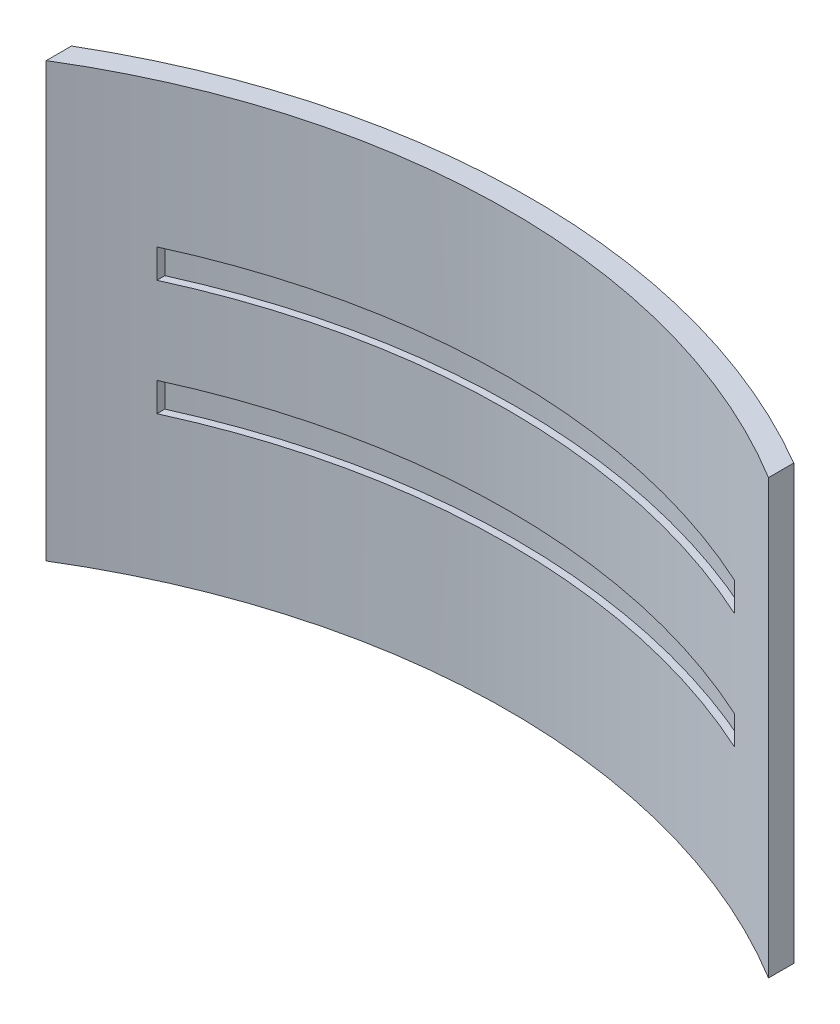
ISO-10303-21;
HEADER;
FILE_DESCRIPTION(('STEP AP214'),'2;1');
FILE_NAME('part.step','',(''),(''),'','','');
FILE_SCHEMA(('AUTOMOTIVE_DESIGN { 1 0 10303 214 1 1 1 1 }'));
ENDSEC;
DATA;
#1=APPLICATION_CONTEXT('core data for automotive mechanical design processes');
#2=APPLICATION_PROTOCOL_DEFINITION('international standard','automotive_design',2000,#1);
#3=PRODUCT_CONTEXT('',#1,'mechanical');
#4=PRODUCT('Part','Part','',(#3));
#5=PRODUCT_RELATED_PRODUCT_CATEGORY('part','',(#4));
#6=PRODUCT_DEFINITION_FORMATION('','',#4);
#7=PRODUCT_DEFINITION_CONTEXT('part definition',#1,'design');
#8=PRODUCT_DEFINITION('design','',#6,#7);
#9=PRODUCT_DEFINITION_SHAPE('','',#8);
#10=(LENGTH_UNIT() NAMED_UNIT(*) SI_UNIT(.MILLI.,.METRE.));
#11=(NAMED_UNIT(*) PLANE_ANGLE_UNIT() SI_UNIT($,.RADIAN.));
#12=(NAMED_UNIT(*) SI_UNIT($,.STERADIAN.) SOLID_ANGLE_UNIT());
#13=UNCERTAINTY_MEASURE_WITH_UNIT(LENGTH_MEASURE(1.E-05),#10,'distance_accuracy_value','');
#14=(GEOMETRIC_REPRESENTATION_CONTEXT(3) GLOBAL_UNCERTAINTY_ASSIGNED_CONTEXT((#13)) GLOBAL_UNIT_ASSIGNED_CONTEXT((#10,
#11,#12)) REPRESENTATION_CONTEXT('',''));
#15=CARTESIAN_POINT('',(0.,0.,0.));
#16=DIRECTION('',(0.,0.,1.));
#17=DIRECTION('',(1.,0.,0.));
#18=AXIS2_PLACEMENT_3D('',#15,#16,#17);
#19=CARTESIAN_POINT('',(0.,30.,0.));
#20=DIRECTION('',(0.,-1.,0.));
#21=DIRECTION('',(0.,0.,-1.));
#22=AXIS2_PLACEMENT_3D('',#19,#20,#21);
#23=CYLINDRICAL_SURFACE('',#22,49.5);
#24=CARTESIAN_POINT('',(0.,5.,0.));
#25=DIRECTION('',(0.,1.,0.));
#26=DIRECTION('',(0.,0.,1.));
#27=AXIS2_PLACEMENT_3D('',#24,#25,#26);
#28=CIRCLE('',#27,49.5);
#29=CARTESIAN_POINT('',(5.,5.,-49.2468273089749));
#30=VERTEX_POINT('',#29);
#31=CARTESIAN_POINT('',(3.,5.,-49.4090072760018));
#32=VERTEX_POINT('',#31);
#33=EDGE_CURVE('E321',#30,#32,#28,.T.);
#34=ORIENTED_EDGE('',*,*,#33,.F.);
#35=DIRECTION('',(0.,-1.,0.));
#36=VECTOR('',#35,1.);
#37=CARTESIAN_POINT('',(5.,30.,-49.2468273089749));
#38=LINE('',#37,#36);
#39=CARTESIAN_POINT('',(5.,25.,-49.2468273089749));
#40=VERTEX_POINT('',#39);
#41=EDGE_CURVE('E315',#40,#30,#38,.T.);
#42=ORIENTED_EDGE('',*,*,#41,.F.);
#43=CARTESIAN_POINT('',(0.,25.,0.));
#44=DIRECTION('',(0.,-1.,0.));
#45=DIRECTION('',(0.,0.,-1.));
#46=AXIS2_PLACEMENT_3D('',#43,#44,#45);
#47=CIRCLE('',#46,49.5);
#48=CARTESIAN_POINT('',(3.,25.,-49.4090072760018));
#49=VERTEX_POINT('',#48);
#50=EDGE_CURVE('E317',#49,#40,#47,.T.);
#51=ORIENTED_EDGE('',*,*,#50,.F.);
#52=DIRECTION('',(0.,-1.,0.));
#53=VECTOR('',#52,1.);
#54=CARTESIAN_POINT('',(3.,30.,-49.4090072760018));
#55=LINE('',#54,#53);
#56=EDGE_CURVE('E319',#32,#49,#55,.F.);
#57=ORIENTED_EDGE('',*,*,#56,.F.);
#58=EDGE_LOOP('',(#34,#42,#51,#57));
#59=FACE_BOUND('',#58,.T.);
#60=CARTESIAN_POINT('',(0.,0.,0.));
#61=DIRECTION('',(0.,1.,0.));
#62=DIRECTION('',(0.,0.,1.));
#63=AXIS2_PLACEMENT_3D('',#60,#61,#62);
#64=CIRCLE('',#63,49.5);
#65=CARTESIAN_POINT('',(25.,0.,-42.722944655068));
#66=VERTEX_POINT('',#65);
#67=CARTESIAN_POINT('',(-25.,0.,-42.722944655068));
#68=VERTEX_POINT('',#67);
#69=EDGE_CURVE('E283',#66,#68,#64,.T.);
#70=ORIENTED_EDGE('',*,*,#69,.T.);
#71=DIRECTION('',(0.,-1.,0.));
#72=VECTOR('',#71,1.);
#73=CARTESIAN_POINT('',(-25.,30.,-42.722944655068));
#74=LINE('',#73,#72);
#75=CARTESIAN_POINT('',(-25.,30.,-42.722944655068));
#76=VERTEX_POINT('',#75);
#77=EDGE_CURVE('E288',#76,#68,#74,.T.);
#78=ORIENTED_EDGE('',*,*,#77,.F.);
#79=CARTESIAN_POINT('',(0.,30.,0.));
#80=DIRECTION('',(0.,1.,0.));
#81=DIRECTION('',(0.,0.,1.));
#82=AXIS2_PLACEMENT_3D('',#79,#80,#81);
#83=CIRCLE('',#82,49.5);
#84=CARTESIAN_POINT('',(25.,30.,-42.722944655068));
#85=VERTEX_POINT('',#84);
#86=EDGE_CURVE('E274',#85,#76,#83,.T.);
#87=ORIENTED_EDGE('',*,*,#86,.F.);
#88=DIRECTION('',(0.,-1.,0.));
#89=VECTOR('',#88,1.);
#90=CARTESIAN_POINT('',(25.,30.,-42.722944655068));
#91=LINE('',#90,#89);
#92=EDGE_CURVE('E291',#85,#66,#91,.T.);
#93=ORIENTED_EDGE('',*,*,#92,.T.);
#94=EDGE_LOOP('',(#70,#78,#87,#93));
#95=FACE_BOUND('',#94,.T.);
#96=CARTESIAN_POINT('',(0.,25.,0.));
#97=DIRECTION('',(0.,-1.,0.));
#98=DIRECTION('',(0.,0.,-1.));
#99=AXIS2_PLACEMENT_3D('',#96,#97,#98);
#100=CIRCLE('',#99,49.5);
#101=CARTESIAN_POINT('',(-5.,25.,-49.2468273089749));
#102=VERTEX_POINT('',#101);
#103=CARTESIAN_POINT('',(-3.,25.,-49.4090072760018));
#104=VERTEX_POINT('',#103);
#105=EDGE_CURVE('E12',#102,#104,#100,.T.);
#106=ORIENTED_EDGE('',*,*,#105,.F.);
#107=DIRECTION('',(0.,-1.,0.));
#108=VECTOR('',#107,1.);
#109=CARTESIAN_POINT('',(-5.,30.,-49.2468273089749));
#110=LINE('',#109,#108);
#111=CARTESIAN_POINT('',(-5.,5.,-49.2468273089749));
#112=VERTEX_POINT('',#111);
#113=EDGE_CURVE('E323',#112,#102,#110,.F.);
#114=ORIENTED_EDGE('',*,*,#113,.F.);
#115=CARTESIAN_POINT('',(0.,5.,0.));
#116=DIRECTION('',(0.,1.,0.));
#117=DIRECTION('',(0.,0.,1.));
#118=AXIS2_PLACEMENT_3D('',#115,#116,#117);
#119=CIRCLE('',#118,49.5);
#120=CARTESIAN_POINT('',(-3.,5.,-49.4090072760018));
#121=VERTEX_POINT('',#120);
#122=EDGE_CURVE('E325',#121,#112,#119,.T.);
#123=ORIENTED_EDGE('',*,*,#122,.F.);
#124=DIRECTION('',(0.,-1.,0.));
#125=VECTOR('',#124,1.);
#126=CARTESIAN_POINT('',(-3.,30.,-49.4090072760018));
#127=LINE('',#126,#125);
#128=EDGE_CURVE('E43',#104,#121,#127,.T.);
#129=ORIENTED_EDGE('',*,*,#128,.F.);
#130=EDGE_LOOP('',(#106,#114,#123,#129));
#131=FACE_BOUND('',#130,.T.);
#132=ADVANCED_FACE('F35',(#59,#95,#131),#23,.T.);
#133=CARTESIAN_POINT('',(0.,30.,0.));
#134=DIRECTION('',(0.,-1.,0.));
#135=DIRECTION('',(0.,0.,-1.));
#136=AXIS2_PLACEMENT_3D('',#133,#134,#135);
#137=CYLINDRICAL_SURFACE('',#136,48.);
#138=DIRECTION('',(0.,-1.,0.));
#139=VECTOR('',#138,1.);
#140=CARTESIAN_POINT('',(-20.0000000000003,30.,-43.6348484585427));
#141=LINE('',#140,#139);
#142=CARTESIAN_POINT('',(-20.0000000000003,12.,-43.6348484585427));
#143=VERTEX_POINT('',#142);
#144=CARTESIAN_POINT('',(-20.0000000000003,10.,-43.6348484585427));
#145=VERTEX_POINT('',#144);
#146=EDGE_CURVE('E304',#143,#145,#141,.T.);
#147=ORIENTED_EDGE('',*,*,#146,.F.);
#148=CARTESIAN_POINT('',(0.,12.,0.));
#149=DIRECTION('',(0.,-1.,0.));
#150=DIRECTION('',(0.,0.,-1.));
#151=AXIS2_PLACEMENT_3D('',#148,#149,#150);
#152=CIRCLE('',#151,48.);
#153=CARTESIAN_POINT('',(19.9999999999997,12.,-43.634848458543));
#154=VERTEX_POINT('',#153);
#155=EDGE_CURVE('E297',#154,#143,#152,.F.);
#156=ORIENTED_EDGE('',*,*,#155,.F.);
#157=DIRECTION('',(0.,-1.,0.));
#158=VECTOR('',#157,1.);
#159=CARTESIAN_POINT('',(19.9999999999997,30.,-43.634848458543));
#160=LINE('',#159,#158);
#161=CARTESIAN_POINT('',(19.9999999999997,10.,-43.634848458543));
#162=VERTEX_POINT('',#161);
#163=EDGE_CURVE('E299',#162,#154,#160,.F.);
#164=ORIENTED_EDGE('',*,*,#163,.F.);
#165=CARTESIAN_POINT('',(0.,10.,0.));
#166=DIRECTION('',(0.,1.,0.));
#167=DIRECTION('',(0.,0.,1.));
#168=AXIS2_PLACEMENT_3D('',#165,#166,#167);
#169=CIRCLE('',#168,48.);
#170=EDGE_CURVE('E302',#145,#162,#169,.F.);
#171=ORIENTED_EDGE('',*,*,#170,.F.);
#172=EDGE_LOOP('',(#147,#156,#164,#171));
#173=FACE_BOUND('',#172,.T.);
#174=CARTESIAN_POINT('',(0.,0.,0.));
#175=DIRECTION('',(0.,-1.,0.));
#176=DIRECTION('',(0.,0.,1.));
#177=AXIS2_PLACEMENT_3D('',#174,#175,#176);
#178=CIRCLE('',#177,48.);
#179=CARTESIAN_POINT('',(-25.,0.,-40.9756024970958));
#180=VERTEX_POINT('',#179);
#181=CARTESIAN_POINT('',(25.,0.,-40.9756024970958));
#182=VERTEX_POINT('',#181);
#183=EDGE_CURVE('E231',#180,#182,#178,.T.);
#184=ORIENTED_EDGE('',*,*,#183,.T.);
#185=DIRECTION('',(0.,-1.,0.));
#186=VECTOR('',#185,1.);
#187=CARTESIAN_POINT('',(25.,30.,-40.9756024970958));
#188=LINE('',#187,#186);
#189=CARTESIAN_POINT('',(25.,30.,-40.9756024970958));
#190=VERTEX_POINT('',#189);
#191=EDGE_CURVE('E294',#190,#182,#188,.T.);
#192=ORIENTED_EDGE('',*,*,#191,.F.);
#193=CARTESIAN_POINT('',(0.,30.,0.));
#194=DIRECTION('',(0.,-1.,0.));
#195=DIRECTION('',(0.,0.,1.));
#196=AXIS2_PLACEMENT_3D('',#193,#194,#195);
#197=CIRCLE('',#196,48.);
#198=CARTESIAN_POINT('',(-25.,30.,-40.9756024970958));
#199=VERTEX_POINT('',#198);
#200=EDGE_CURVE('E268',#199,#190,#197,.T.);
#201=ORIENTED_EDGE('',*,*,#200,.F.);
#202=DIRECTION('',(0.,-1.,0.));
#203=VECTOR('',#202,1.);
#204=CARTESIAN_POINT('',(-25.,30.,-40.9756024970958));
#205=LINE('',#204,#203);
#206=EDGE_CURVE('E278',#199,#180,#205,.T.);
#207=ORIENTED_EDGE('',*,*,#206,.T.);
#208=EDGE_LOOP('',(#184,#192,#201,#207));
#209=FACE_BOUND('',#208,.T.);
#210=CARTESIAN_POINT('',(0.,20.,0.));
#211=DIRECTION('',(0.,-1.,0.));
#212=DIRECTION('',(0.,0.,-1.));
#213=AXIS2_PLACEMENT_3D('',#210,#211,#212);
#214=CIRCLE('',#213,48.);
#215=CARTESIAN_POINT('',(19.9999999999997,20.,-43.634848458543));
#216=VERTEX_POINT('',#215);
#217=CARTESIAN_POINT('',(-20.0000000000003,20.,-43.6348484585427));
#218=VERTEX_POINT('',#217);
#219=EDGE_CURVE('E313',#216,#218,#214,.F.);
#220=ORIENTED_EDGE('',*,*,#219,.F.);
#221=DIRECTION('',(0.,-1.,0.));
#222=VECTOR('',#221,1.);
#223=CARTESIAN_POINT('',(19.9999999999997,30.,-43.634848458543));
#224=LINE('',#223,#222);
#225=CARTESIAN_POINT('',(19.9999999999997,18.,-43.634848458543));
#226=VERTEX_POINT('',#225);
#227=EDGE_CURVE('E306',#226,#216,#224,.F.);
#228=ORIENTED_EDGE('',*,*,#227,.F.);
#229=CARTESIAN_POINT('',(0.,18.,0.));
#230=DIRECTION('',(0.,1.,0.));
#231=DIRECTION('',(0.,0.,1.));
#232=AXIS2_PLACEMENT_3D('',#229,#230,#231);
#233=CIRCLE('',#232,48.);
#234=CARTESIAN_POINT('',(-20.0000000000003,18.,-43.6348484585427));
#235=VERTEX_POINT('',#234);
#236=EDGE_CURVE('E308',#235,#226,#233,.F.);
#237=ORIENTED_EDGE('',*,*,#236,.F.);
#238=DIRECTION('',(0.,-1.,0.));
#239=VECTOR('',#238,1.);
#240=CARTESIAN_POINT('',(-20.0000000000003,30.,-43.6348484585427));
#241=LINE('',#240,#239);
#242=EDGE_CURVE('E311',#218,#235,#241,.T.);
#243=ORIENTED_EDGE('',*,*,#242,.F.);
#244=EDGE_LOOP('',(#220,#228,#237,#243));
#245=FACE_BOUND('',#244,.T.);
#246=ADVANCED_FACE('F37',(#173,#209,#245),#137,.F.);
#247=CARTESIAN_POINT('',(25.,30.,-42.722944655068));
#248=DIRECTION('',(-1.,0.,0.));
#249=DIRECTION('',(0.,0.,1.));
#250=AXIS2_PLACEMENT_3D('',#247,#248,#249);
#251=PLANE('',#250);
#252=DIRECTION('',(0.,0.,-1.));
#253=VECTOR('',#252,1.);
#254=CARTESIAN_POINT('',(25.,0.,-42.722944655068));
#255=LINE('',#254,#253);
#256=EDGE_CURVE('E281',#182,#66,#255,.T.);
#257=ORIENTED_EDGE('',*,*,#256,.T.);
#258=ORIENTED_EDGE('',*,*,#92,.F.);
#259=DIRECTION('',(0.,0.,-1.));
#260=VECTOR('',#259,1.);
#261=CARTESIAN_POINT('',(25.,30.,-42.722944655068));
#262=LINE('',#261,#260);
#263=EDGE_CURVE('E271',#190,#85,#262,.T.);
#264=ORIENTED_EDGE('',*,*,#263,.F.);
#265=ORIENTED_EDGE('',*,*,#191,.T.);
#266=EDGE_LOOP('',(#257,#258,#264,#265));
#267=FACE_BOUND('',#266,.T.);
#268=ADVANCED_FACE('F352',(#267),#251,.F.);
#269=CARTESIAN_POINT('',(-25.,30.,-42.722944655068));
#270=DIRECTION('',(1.,0.,0.));
#271=DIRECTION('',(0.,0.,-1.));
#272=AXIS2_PLACEMENT_3D('',#269,#270,#271);
#273=PLANE('',#272);
#274=DIRECTION('',(0.,0.,1.));
#275=VECTOR('',#274,1.);
#276=CARTESIAN_POINT('',(-25.,0.,-42.722944655068));
#277=LINE('',#276,#275);
#278=EDGE_CURVE('E272',#68,#180,#277,.T.);
#279=ORIENTED_EDGE('',*,*,#278,.T.);
#280=ORIENTED_EDGE('',*,*,#206,.F.);
#281=DIRECTION('',(0.,0.,1.));
#282=VECTOR('',#281,1.);
#283=CARTESIAN_POINT('',(-25.,30.,-42.722944655068));
#284=LINE('',#283,#282);
#285=EDGE_CURVE('E276',#76,#199,#284,.T.);
#286=ORIENTED_EDGE('',*,*,#285,.F.);
#287=ORIENTED_EDGE('',*,*,#77,.T.);
#288=EDGE_LOOP('',(#279,#280,#286,#287));
#289=FACE_BOUND('',#288,.T.);
#290=ADVANCED_FACE('F357',(#289),#273,.F.);
#291=CARTESIAN_POINT('',(0.,30.,0.));
#292=DIRECTION('',(0.,1.,0.));
#293=DIRECTION('',(0.,0.,1.));
#294=AXIS2_PLACEMENT_3D('',#291,#292,#293);
#295=PLANE('',#294);
#296=ORIENTED_EDGE('',*,*,#200,.T.);
#297=ORIENTED_EDGE('',*,*,#263,.T.);
#298=ORIENTED_EDGE('',*,*,#86,.T.);
#299=ORIENTED_EDGE('',*,*,#285,.T.);
#300=EDGE_LOOP('',(#296,#297,#298,#299));
#301=FACE_BOUND('',#300,.T.);
#302=ADVANCED_FACE('F364',(#301),#295,.T.);
#303=CARTESIAN_POINT('',(0.,0.,0.));
#304=DIRECTION('',(0.,1.,0.));
#305=DIRECTION('',(0.,0.,1.));
#306=AXIS2_PLACEMENT_3D('',#303,#304,#305);
#307=PLANE('',#306);
#308=ORIENTED_EDGE('',*,*,#183,.F.);
#309=ORIENTED_EDGE('',*,*,#278,.F.);
#310=ORIENTED_EDGE('',*,*,#69,.F.);
#311=ORIENTED_EDGE('',*,*,#256,.F.);
#312=EDGE_LOOP('',(#308,#309,#310,#311));
#313=FACE_BOUND('',#312,.T.);
#314=ADVANCED_FACE('F374',(#313),#307,.F.);
#315=CARTESIAN_POINT('',(-20.0000000000004,12.,-51.501));
#316=DIRECTION('',(1.,0.,0.));
#317=DIRECTION('',(0.,0.,-1.));
#318=AXIS2_PLACEMENT_3D('',#315,#316,#317);
#319=PLANE('',#318);
#320=ORIENTED_EDGE('',*,*,#146,.T.);
#321=DIRECTION('',(0.,0.,1.));
#322=VECTOR('',#321,1.);
#323=CARTESIAN_POINT('',(-20.0000000000004,10.,-51.501));
#324=LINE('',#323,#322);
#325=CARTESIAN_POINT('',(-20.0000000000003,10.,-44.1842732202306));
#326=VERTEX_POINT('',#325);
#327=EDGE_CURVE('E258',#326,#145,#324,.T.);
#328=ORIENTED_EDGE('',*,*,#327,.F.);
#329=DIRECTION('',(0.,-1.,0.));
#330=VECTOR('',#329,1.);
#331=CARTESIAN_POINT('',(-20.0000000000003,30.,-44.1842732202306));
#332=LINE('',#331,#330);
#333=CARTESIAN_POINT('',(-20.0000000000003,12.,-44.1842732202306));
#334=VERTEX_POINT('',#333);
#335=EDGE_CURVE('E250',#334,#326,#332,.T.);
#336=ORIENTED_EDGE('',*,*,#335,.F.);
#337=DIRECTION('',(0.,0.,1.));
#338=VECTOR('',#337,1.);
#339=CARTESIAN_POINT('',(-20.0000000000004,12.,-51.501));
#340=LINE('',#339,#338);
#341=EDGE_CURVE('E255',#334,#143,#340,.T.);
#342=ORIENTED_EDGE('',*,*,#341,.T.);
#343=EDGE_LOOP('',(#320,#328,#336,#342));
#344=FACE_BOUND('',#343,.T.);
#345=ADVANCED_FACE('F386',(#344),#319,.T.);
#346=CARTESIAN_POINT('',(19.9999999999996,10.,-51.5010000000003));
#347=DIRECTION('',(0.,1.,0.));
#348=DIRECTION('',(0.,0.,1.));
#349=AXIS2_PLACEMENT_3D('',#346,#347,#348);
#350=PLANE('',#349);
#351=ORIENTED_EDGE('',*,*,#170,.T.);
#352=DIRECTION('',(0.,0.,1.));
#353=VECTOR('',#352,1.);
#354=CARTESIAN_POINT('',(19.9999999999996,10.,-51.5010000000003));
#355=LINE('',#354,#353);
#356=CARTESIAN_POINT('',(19.9999999999997,10.,-44.1842732202309));
#357=VERTEX_POINT('',#356);
#358=EDGE_CURVE('E261',#357,#162,#355,.T.);
#359=ORIENTED_EDGE('',*,*,#358,.F.);
#360=CARTESIAN_POINT('',(0.,10.,0.));
#361=DIRECTION('',(0.,1.,0.));
#362=DIRECTION('',(0.,0.,1.));
#363=AXIS2_PLACEMENT_3D('',#360,#361,#362);
#364=CIRCLE('',#363,48.5);
#365=EDGE_CURVE('E246',#326,#357,#364,.F.);
#366=ORIENTED_EDGE('',*,*,#365,.F.);
#367=ORIENTED_EDGE('',*,*,#327,.T.);
#368=EDGE_LOOP('',(#351,#359,#366,#367));
#369=FACE_BOUND('',#368,.T.);
#370=ADVANCED_FACE('F396',(#369),#350,.T.);
#371=CARTESIAN_POINT('',(19.9999999999996,12.,-51.5010000000003));
#372=DIRECTION('',(-1.,0.,0.));
#373=DIRECTION('',(0.,0.,1.));
#374=AXIS2_PLACEMENT_3D('',#371,#372,#373);
#375=PLANE('',#374);
#376=ORIENTED_EDGE('',*,*,#163,.T.);
#377=DIRECTION('',(0.,0.,1.));
#378=VECTOR('',#377,1.);
#379=CARTESIAN_POINT('',(19.9999999999996,12.,-51.5010000000003));
#380=LINE('',#379,#378);
#381=CARTESIAN_POINT('',(19.9999999999997,12.,-44.1842732202309));
#382=VERTEX_POINT('',#381);
#383=EDGE_CURVE('E264',#382,#154,#380,.T.);
#384=ORIENTED_EDGE('',*,*,#383,.F.);
#385=DIRECTION('',(0.,-1.,0.));
#386=VECTOR('',#385,1.);
#387=CARTESIAN_POINT('',(19.9999999999997,30.,-44.1842732202309));
#388=LINE('',#387,#386);
#389=EDGE_CURVE('E249',#357,#382,#388,.F.);
#390=ORIENTED_EDGE('',*,*,#389,.F.);
#391=ORIENTED_EDGE('',*,*,#358,.T.);
#392=EDGE_LOOP('',(#376,#384,#390,#391));
#393=FACE_BOUND('',#392,.T.);
#394=ADVANCED_FACE('F392',(#393),#375,.T.);
#395=CARTESIAN_POINT('',(19.9999999999996,12.,-51.5010000000003));
#396=DIRECTION('',(0.,-1.,0.));
#397=DIRECTION('',(0.,0.,-1.));
#398=AXIS2_PLACEMENT_3D('',#395,#396,#397);
#399=PLANE('',#398);
#400=ORIENTED_EDGE('',*,*,#155,.T.);
#401=ORIENTED_EDGE('',*,*,#341,.F.);
#402=CARTESIAN_POINT('',(0.,12.,0.));
#403=DIRECTION('',(0.,-1.,0.));
#404=DIRECTION('',(0.,0.,-1.));
#405=AXIS2_PLACEMENT_3D('',#402,#403,#404);
#406=CIRCLE('',#405,48.5);
#407=EDGE_CURVE('E236',#382,#334,#406,.F.);
#408=ORIENTED_EDGE('',*,*,#407,.F.);
#409=ORIENTED_EDGE('',*,*,#383,.T.);
#410=EDGE_LOOP('',(#400,#401,#408,#409));
#411=FACE_BOUND('',#410,.T.);
#412=ADVANCED_FACE('F388',(#411),#399,.T.);
#413=CARTESIAN_POINT('',(0.,30.,0.));
#414=DIRECTION('',(0.,-1.,0.));
#415=DIRECTION('',(0.,0.,-1.));
#416=AXIS2_PLACEMENT_3D('',#413,#414,#415);
#417=CYLINDRICAL_SURFACE('',#416,48.5);
#418=ORIENTED_EDGE('',*,*,#389,.T.);
#419=ORIENTED_EDGE('',*,*,#407,.T.);
#420=ORIENTED_EDGE('',*,*,#335,.T.);
#421=ORIENTED_EDGE('',*,*,#365,.T.);
#422=EDGE_LOOP('',(#418,#419,#420,#421));
#423=FACE_BOUND('',#422,.T.);
#424=ADVANCED_FACE('F391',(#423),#417,.F.);
#425=CARTESIAN_POINT('',(19.9999999999996,20.,-51.5010000000003));
#426=DIRECTION('',(0.,-1.,0.));
#427=DIRECTION('',(0.,0.,-1.));
#428=AXIS2_PLACEMENT_3D('',#425,#426,#427);
#429=PLANE('',#428);
#430=ORIENTED_EDGE('',*,*,#219,.T.);
#431=DIRECTION('',(0.,0.,1.));
#432=VECTOR('',#431,1.);
#433=CARTESIAN_POINT('',(-20.0000000000004,20.,-51.501));
#434=LINE('',#433,#432);
#435=CARTESIAN_POINT('',(-20.0000000000003,20.,-44.1842732202306));
#436=VERTEX_POINT('',#435);
#437=EDGE_CURVE('E235',#436,#218,#434,.T.);
#438=ORIENTED_EDGE('',*,*,#437,.F.);
#439=CARTESIAN_POINT('',(0.,20.,0.));
#440=DIRECTION('',(0.,-1.,0.));
#441=DIRECTION('',(0.,0.,-1.));
#442=AXIS2_PLACEMENT_3D('',#439,#440,#441);
#443=CIRCLE('',#442,48.5);
#444=CARTESIAN_POINT('',(19.9999999999997,20.,-44.1842732202309));
#445=VERTEX_POINT('',#444);
#446=EDGE_CURVE('E225',#445,#436,#443,.F.);
#447=ORIENTED_EDGE('',*,*,#446,.F.);
#448=DIRECTION('',(0.,0.,1.));
#449=VECTOR('',#448,1.);
#450=CARTESIAN_POINT('',(19.9999999999996,20.,-51.5010000000003));
#451=LINE('',#450,#449);
#452=EDGE_CURVE('E232',#445,#216,#451,.T.);
#453=ORIENTED_EDGE('',*,*,#452,.T.);
#454=EDGE_LOOP('',(#430,#438,#447,#453));
#455=FACE_BOUND('',#454,.T.);
#456=ADVANCED_FACE('F406',(#455),#429,.T.);
#457=CARTESIAN_POINT('',(-20.0000000000004,18.,-51.501));
#458=DIRECTION('',(1.,0.,0.));
#459=DIRECTION('',(0.,0.,-1.));
#460=AXIS2_PLACEMENT_3D('',#457,#458,#459);
#461=PLANE('',#460);
#462=ORIENTED_EDGE('',*,*,#242,.T.);
#463=DIRECTION('',(0.,0.,1.));
#464=VECTOR('',#463,1.);
#465=CARTESIAN_POINT('',(-20.0000000000004,18.,-51.501));
#466=LINE('',#465,#464);
#467=CARTESIAN_POINT('',(-20.0000000000003,18.,-44.1842732202306));
#468=VERTEX_POINT('',#467);
#469=EDGE_CURVE('E239',#468,#235,#466,.T.);
#470=ORIENTED_EDGE('',*,*,#469,.F.);
#471=DIRECTION('',(0.,-1.,0.));
#472=VECTOR('',#471,1.);
#473=CARTESIAN_POINT('',(-20.0000000000003,30.,-44.1842732202306));
#474=LINE('',#473,#472);
#475=EDGE_CURVE('E221',#436,#468,#474,.T.);
#476=ORIENTED_EDGE('',*,*,#475,.F.);
#477=ORIENTED_EDGE('',*,*,#437,.T.);
#478=EDGE_LOOP('',(#462,#470,#476,#477));
#479=FACE_BOUND('',#478,.T.);
#480=ADVANCED_FACE('F416',(#479),#461,.T.);
#481=CARTESIAN_POINT('',(19.9999999999996,18.,-51.5010000000003));
#482=DIRECTION('',(0.,1.,0.));
#483=DIRECTION('',(0.,0.,1.));
#484=AXIS2_PLACEMENT_3D('',#481,#482,#483);
#485=PLANE('',#484);
#486=ORIENTED_EDGE('',*,*,#236,.T.);
#487=DIRECTION('',(0.,0.,1.));
#488=VECTOR('',#487,1.);
#489=CARTESIAN_POINT('',(19.9999999999996,18.,-51.5010000000003));
#490=LINE('',#489,#488);
#491=CARTESIAN_POINT('',(19.9999999999997,18.,-44.1842732202309));
#492=VERTEX_POINT('',#491);
#493=EDGE_CURVE('E242',#492,#226,#490,.T.);
#494=ORIENTED_EDGE('',*,*,#493,.F.);
#495=CARTESIAN_POINT('',(0.,18.,0.));
#496=DIRECTION('',(0.,1.,0.));
#497=DIRECTION('',(0.,0.,1.));
#498=AXIS2_PLACEMENT_3D('',#495,#496,#497);
#499=CIRCLE('',#498,48.5);
#500=EDGE_CURVE('E224',#468,#492,#499,.F.);
#501=ORIENTED_EDGE('',*,*,#500,.F.);
#502=ORIENTED_EDGE('',*,*,#469,.T.);
#503=EDGE_LOOP('',(#486,#494,#501,#502));
#504=FACE_BOUND('',#503,.T.);
#505=ADVANCED_FACE('F412',(#504),#485,.T.);
#506=CARTESIAN_POINT('',(19.9999999999996,18.,-51.5010000000003));
#507=DIRECTION('',(-1.,0.,0.));
#508=DIRECTION('',(0.,0.,1.));
#509=AXIS2_PLACEMENT_3D('',#506,#507,#508);
#510=PLANE('',#509);
#511=ORIENTED_EDGE('',*,*,#227,.T.);
#512=ORIENTED_EDGE('',*,*,#452,.F.);
#513=DIRECTION('',(0.,-1.,0.));
#514=VECTOR('',#513,1.);
#515=CARTESIAN_POINT('',(19.9999999999997,30.,-44.1842732202309));
#516=LINE('',#515,#514);
#517=EDGE_CURVE('E228',#492,#445,#516,.F.);
#518=ORIENTED_EDGE('',*,*,#517,.F.);
#519=ORIENTED_EDGE('',*,*,#493,.T.);
#520=EDGE_LOOP('',(#511,#512,#518,#519));
#521=FACE_BOUND('',#520,.T.);
#522=ADVANCED_FACE('F408',(#521),#510,.T.);
#523=CARTESIAN_POINT('',(0.,30.,0.));
#524=DIRECTION('',(0.,-1.,0.));
#525=DIRECTION('',(0.,0.,-1.));
#526=AXIS2_PLACEMENT_3D('',#523,#524,#525);
#527=CYLINDRICAL_SURFACE('',#526,48.5);
#528=ORIENTED_EDGE('',*,*,#500,.T.);
#529=ORIENTED_EDGE('',*,*,#517,.T.);
#530=ORIENTED_EDGE('',*,*,#446,.T.);
#531=ORIENTED_EDGE('',*,*,#475,.T.);
#532=EDGE_LOOP('',(#528,#529,#530,#531));
#533=FACE_BOUND('',#532,.T.);
#534=ADVANCED_FACE('F411',(#533),#527,.F.);
#535=CARTESIAN_POINT('',(5.,5.,-38.9746024970958));
#536=DIRECTION('',(0.,1.,0.));
#537=DIRECTION('',(0.,0.,1.));
#538=AXIS2_PLACEMENT_3D('',#535,#536,#537);
#539=PLANE('',#538);
#540=ORIENTED_EDGE('',*,*,#33,.T.);
#541=DIRECTION('',(0.,0.,-1.));
#542=VECTOR('',#541,1.);
#543=CARTESIAN_POINT('',(3.,5.,-38.9746024970958));
#544=LINE('',#543,#542);
#545=CARTESIAN_POINT('',(3.,5.,-48.9080770425499));
#546=VERTEX_POINT('',#545);
#547=EDGE_CURVE('E212',#546,#32,#544,.T.);
#548=ORIENTED_EDGE('',*,*,#547,.F.);
#549=CARTESIAN_POINT('',(0.,5.,0.));
#550=DIRECTION('',(0.,1.,0.));
#551=DIRECTION('',(0.,0.,1.));
#552=AXIS2_PLACEMENT_3D('',#549,#550,#551);
#553=CIRCLE('',#552,49.);
#554=CARTESIAN_POINT('',(5.,5.,-48.7442304278158));
#555=VERTEX_POINT('',#554);
#556=EDGE_CURVE('E203',#555,#546,#553,.T.);
#557=ORIENTED_EDGE('',*,*,#556,.F.);
#558=DIRECTION('',(0.,0.,-1.));
#559=VECTOR('',#558,1.);
#560=CARTESIAN_POINT('',(5.,5.,-38.9746024970958));
#561=LINE('',#560,#559);
#562=EDGE_CURVE('E209',#555,#30,#561,.T.);
#563=ORIENTED_EDGE('',*,*,#562,.T.);
#564=EDGE_LOOP('',(#540,#548,#557,#563));
#565=FACE_BOUND('',#564,.T.);
#566=ADVANCED_FACE('F426',(#565),#539,.T.);
#567=CARTESIAN_POINT('',(3.,5.,-38.9746024970958));
#568=DIRECTION('',(1.,0.,0.));
#569=DIRECTION('',(0.,0.,-1.));
#570=AXIS2_PLACEMENT_3D('',#567,#568,#569);
#571=PLANE('',#570);
#572=ORIENTED_EDGE('',*,*,#56,.T.);
#573=DIRECTION('',(0.,0.,-1.));
#574=VECTOR('',#573,1.);
#575=CARTESIAN_POINT('',(3.,25.,-38.9746024970958));
#576=LINE('',#575,#574);
#577=CARTESIAN_POINT('',(3.,25.,-48.9080770425499));
#578=VERTEX_POINT('',#577);
#579=EDGE_CURVE('E215',#578,#49,#576,.T.);
#580=ORIENTED_EDGE('',*,*,#579,.F.);
#581=DIRECTION('',(0.,-1.,0.));
#582=VECTOR('',#581,1.);
#583=CARTESIAN_POINT('',(3.,30.,-48.9080770425499));
#584=LINE('',#583,#582);
#585=EDGE_CURVE('E199',#546,#578,#584,.F.);
#586=ORIENTED_EDGE('',*,*,#585,.F.);
#587=ORIENTED_EDGE('',*,*,#547,.T.);
#588=EDGE_LOOP('',(#572,#580,#586,#587));
#589=FACE_BOUND('',#588,.T.);
#590=ADVANCED_FACE('F435',(#589),#571,.T.);
#591=CARTESIAN_POINT('',(5.,25.,-38.9746024970958));
#592=DIRECTION('',(0.,-1.,0.));
#593=DIRECTION('',(0.,0.,-1.));
#594=AXIS2_PLACEMENT_3D('',#591,#592,#593);
#595=PLANE('',#594);
#596=ORIENTED_EDGE('',*,*,#50,.T.);
#597=DIRECTION('',(0.,0.,-1.));
#598=VECTOR('',#597,1.);
#599=CARTESIAN_POINT('',(5.,25.,-38.9746024970958));
#600=LINE('',#599,#598);
#601=CARTESIAN_POINT('',(5.,25.,-48.7442304278158));
#602=VERTEX_POINT('',#601);
#603=EDGE_CURVE('E58',#602,#40,#600,.T.);
#604=ORIENTED_EDGE('',*,*,#603,.F.);
#605=CARTESIAN_POINT('',(0.,25.,0.));
#606=DIRECTION('',(0.,-1.,0.));
#607=DIRECTION('',(0.,0.,-1.));
#608=AXIS2_PLACEMENT_3D('',#605,#606,#607);
#609=CIRCLE('',#608,49.);
#610=EDGE_CURVE('E202',#578,#602,#609,.T.);
#611=ORIENTED_EDGE('',*,*,#610,.F.);
#612=ORIENTED_EDGE('',*,*,#579,.T.);
#613=EDGE_LOOP('',(#596,#604,#611,#612));
#614=FACE_BOUND('',#613,.T.);
#615=ADVANCED_FACE('F432',(#614),#595,.T.);
#616=CARTESIAN_POINT('',(5.,5.,-38.9746024970958));
#617=DIRECTION('',(-1.,0.,0.));
#618=DIRECTION('',(0.,-1.,0.));
#619=AXIS2_PLACEMENT_3D('',#616,#617,#618);
#620=PLANE('',#619);
#621=ORIENTED_EDGE('',*,*,#41,.T.);
#622=ORIENTED_EDGE('',*,*,#562,.F.);
#623=DIRECTION('',(0.,-1.,0.));
#624=VECTOR('',#623,1.);
#625=CARTESIAN_POINT('',(5.,30.,-48.7442304278158));
#626=LINE('',#625,#624);
#627=EDGE_CURVE('E206',#602,#555,#626,.T.);
#628=ORIENTED_EDGE('',*,*,#627,.F.);
#629=ORIENTED_EDGE('',*,*,#603,.T.);
#630=EDGE_LOOP('',(#621,#622,#628,#629));
#631=FACE_BOUND('',#630,.T.);
#632=ADVANCED_FACE('F428',(#631),#620,.T.);
#633=CARTESIAN_POINT('',(0.,30.,0.));
#634=DIRECTION('',(0.,-1.,0.));
#635=DIRECTION('',(0.,0.,-1.));
#636=AXIS2_PLACEMENT_3D('',#633,#634,#635);
#637=CYLINDRICAL_SURFACE('',#636,49.);
#638=ORIENTED_EDGE('',*,*,#610,.T.);
#639=ORIENTED_EDGE('',*,*,#627,.T.);
#640=ORIENTED_EDGE('',*,*,#556,.T.);
#641=ORIENTED_EDGE('',*,*,#585,.T.);
#642=EDGE_LOOP('',(#638,#639,#640,#641));
#643=FACE_BOUND('',#642,.T.);
#644=ADVANCED_FACE('F431',(#643),#637,.T.);
#645=CARTESIAN_POINT('',(-5.,25.,-38.9746024970958));
#646=DIRECTION('',(0.,-1.,0.));
#647=DIRECTION('',(0.,0.,-1.));
#648=AXIS2_PLACEMENT_3D('',#645,#646,#647);
#649=PLANE('',#648);
#650=ORIENTED_EDGE('',*,*,#105,.T.);
#651=DIRECTION('',(0.,0.,-1.));
#652=VECTOR('',#651,1.);
#653=CARTESIAN_POINT('',(-3.,25.,-38.9746024970958));
#654=LINE('',#653,#652);
#655=CARTESIAN_POINT('',(-3.,25.,-48.9080770425499));
#656=VERTEX_POINT('',#655);
#657=EDGE_CURVE('E175',#656,#104,#654,.T.);
#658=ORIENTED_EDGE('',*,*,#657,.F.);
#659=CARTESIAN_POINT('',(0.,25.,0.));
#660=DIRECTION('',(0.,-1.,0.));
#661=DIRECTION('',(0.,0.,-1.));
#662=AXIS2_PLACEMENT_3D('',#659,#660,#661);
#663=CIRCLE('',#662,49.);
#664=CARTESIAN_POINT('',(-5.,25.,-48.7442304278158));
#665=VERTEX_POINT('',#664);
#666=EDGE_CURVE('E183',#665,#656,#663,.T.);
#667=ORIENTED_EDGE('',*,*,#666,.F.);
#668=DIRECTION('',(0.,0.,-1.));
#669=VECTOR('',#668,1.);
#670=CARTESIAN_POINT('',(-5.,25.,-38.9746024970958));
#671=LINE('',#670,#669);
#672=EDGE_CURVE('E190',#665,#102,#671,.T.);
#673=ORIENTED_EDGE('',*,*,#672,.T.);
#674=EDGE_LOOP('',(#650,#658,#667,#673));
#675=FACE_BOUND('',#674,.T.);
#676=ADVANCED_FACE('F186',(#675),#649,.T.);
#677=CARTESIAN_POINT('',(-3.,5.,-38.9746024970958));
#678=DIRECTION('',(-1.,0.,0.));
#679=DIRECTION('',(0.,0.,1.));
#680=AXIS2_PLACEMENT_3D('',#677,#678,#679);
#681=PLANE('',#680);
#682=ORIENTED_EDGE('',*,*,#128,.T.);
#683=DIRECTION('',(0.,0.,-1.));
#684=VECTOR('',#683,1.);
#685=CARTESIAN_POINT('',(-3.,5.,-38.9746024970958));
#686=LINE('',#685,#684);
#687=CARTESIAN_POINT('',(-3.,5.,-48.9080770425499));
#688=VERTEX_POINT('',#687);
#689=EDGE_CURVE('E178',#688,#121,#686,.T.);
#690=ORIENTED_EDGE('',*,*,#689,.F.);
#691=DIRECTION('',(0.,-1.,0.));
#692=VECTOR('',#691,1.);
#693=CARTESIAN_POINT('',(-3.,30.,-48.9080770425499));
#694=LINE('',#693,#692);
#695=EDGE_CURVE('E172',#656,#688,#694,.T.);
#696=ORIENTED_EDGE('',*,*,#695,.F.);
#697=ORIENTED_EDGE('',*,*,#657,.T.);
#698=EDGE_LOOP('',(#682,#690,#696,#697));
#699=FACE_BOUND('',#698,.T.);
#700=ADVANCED_FACE('F174',(#699),#681,.T.);
#701=CARTESIAN_POINT('',(-5.,5.,-38.9746024970958));
#702=DIRECTION('',(0.,1.,0.));
#703=DIRECTION('',(0.,0.,1.));
#704=AXIS2_PLACEMENT_3D('',#701,#702,#703);
#705=PLANE('',#704);
#706=ORIENTED_EDGE('',*,*,#122,.T.);
#707=DIRECTION('',(0.,0.,-1.));
#708=VECTOR('',#707,1.);
#709=CARTESIAN_POINT('',(-5.,5.,-38.9746024970958));
#710=LINE('',#709,#708);
#711=CARTESIAN_POINT('',(-5.,5.,-48.7442304278158));
#712=VERTEX_POINT('',#711);
#713=EDGE_CURVE('E50',#712,#112,#710,.T.);
#714=ORIENTED_EDGE('',*,*,#713,.F.);
#715=CARTESIAN_POINT('',(0.,5.,0.));
#716=DIRECTION('',(0.,1.,0.));
#717=DIRECTION('',(0.,0.,1.));
#718=AXIS2_PLACEMENT_3D('',#715,#716,#717);
#719=CIRCLE('',#718,49.);
#720=EDGE_CURVE('E182',#688,#712,#719,.T.);
#721=ORIENTED_EDGE('',*,*,#720,.F.);
#722=ORIENTED_EDGE('',*,*,#689,.T.);
#723=EDGE_LOOP('',(#706,#714,#721,#722));
#724=FACE_BOUND('',#723,.T.);
#725=ADVANCED_FACE('F329',(#724),#705,.T.);
#726=CARTESIAN_POINT('',(-5.,5.,-38.9746024970958));
#727=DIRECTION('',(1.,0.,0.));
#728=DIRECTION('',(0.,1.,0.));
#729=AXIS2_PLACEMENT_3D('',#726,#727,#728);
#730=PLANE('',#729);
#731=ORIENTED_EDGE('',*,*,#113,.T.);
#732=ORIENTED_EDGE('',*,*,#672,.F.);
#733=DIRECTION('',(0.,-1.,0.));
#734=VECTOR('',#733,1.);
#735=CARTESIAN_POINT('',(-5.,30.,-48.7442304278158));
#736=LINE('',#735,#734);
#737=EDGE_CURVE('E193',#712,#665,#736,.F.);
#738=ORIENTED_EDGE('',*,*,#737,.F.);
#739=ORIENTED_EDGE('',*,*,#713,.T.);
#740=EDGE_LOOP('',(#731,#732,#738,#739));
#741=FACE_BOUND('',#740,.T.);
#742=ADVANCED_FACE('F331',(#741),#730,.T.);
#743=CARTESIAN_POINT('',(0.,30.,0.));
#744=DIRECTION('',(0.,-1.,0.));
#745=DIRECTION('',(0.,0.,-1.));
#746=AXIS2_PLACEMENT_3D('',#743,#744,#745);
#747=CYLINDRICAL_SURFACE('',#746,49.);
#748=ORIENTED_EDGE('',*,*,#720,.T.);
#749=ORIENTED_EDGE('',*,*,#737,.T.);
#750=ORIENTED_EDGE('',*,*,#666,.T.);
#751=ORIENTED_EDGE('',*,*,#695,.T.);
#752=EDGE_LOOP('',(#748,#749,#750,#751));
#753=FACE_BOUND('',#752,.T.);
#754=ADVANCED_FACE('F192',(#753),#747,.T.);
#755=CLOSED_SHELL('',(#132,#246,#268,#290,#302,#314,#345,#370,#394,#412,#424,#456,#480,#505,
#522,#534,#566,#590,#615,#632,#644,#676,#700,#725,#742,#754));
#756=MANIFOLD_SOLID_BREP('B2',#755);
#757=ADVANCED_BREP_SHAPE_REPRESENTATION('',(#18,#756),#14);
#758=SHAPE_DEFINITION_REPRESENTATION(#9,#757);
ENDSEC;
END-ISO-10303-21;
